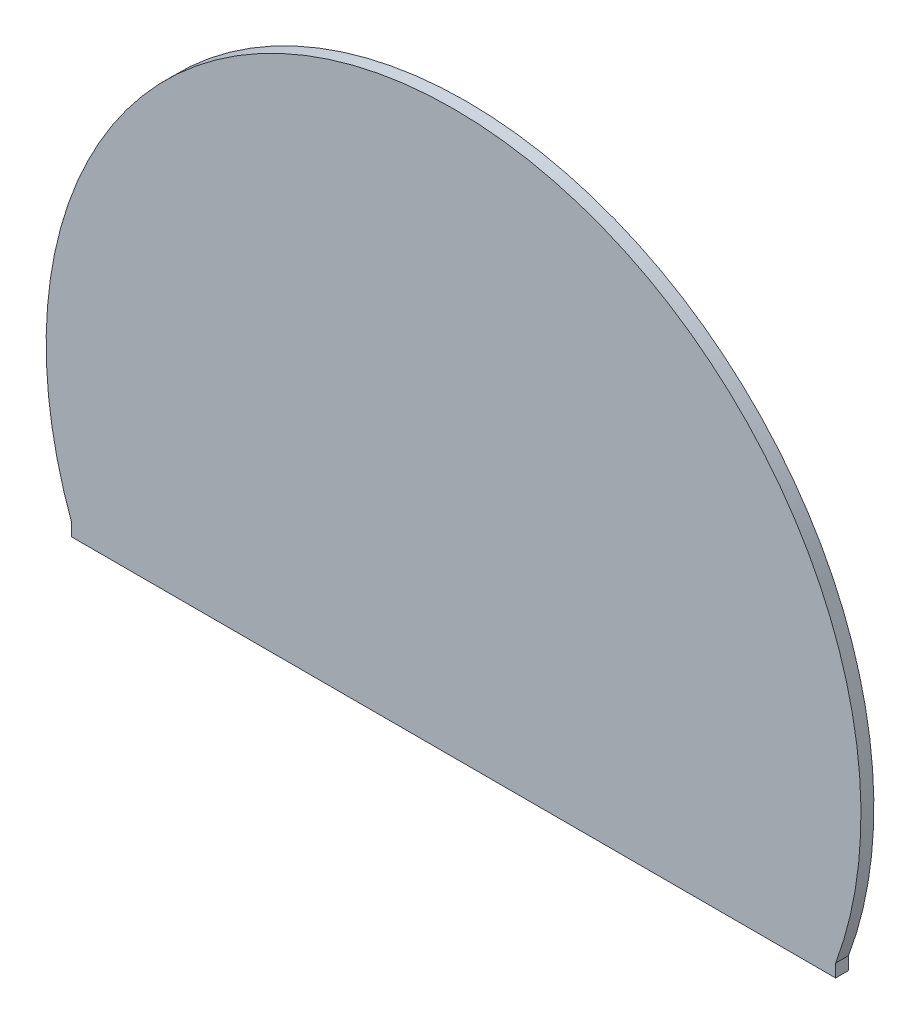
ISO-10303-21;
HEADER;
FILE_DESCRIPTION(('STEP AP214'),'2;1');
FILE_NAME('part.step','',(''),(''),'','','');
FILE_SCHEMA(('AUTOMOTIVE_DESIGN { 1 0 10303 214 1 1 1 1 }'));
ENDSEC;
DATA;
#1=APPLICATION_CONTEXT('core data for automotive mechanical design processes');
#2=APPLICATION_PROTOCOL_DEFINITION('international standard','automotive_design',2000,#1);
#3=PRODUCT_CONTEXT('',#1,'mechanical');
#4=PRODUCT('Part','Part','',(#3));
#5=PRODUCT_RELATED_PRODUCT_CATEGORY('part','',(#4));
#6=PRODUCT_DEFINITION_FORMATION('','',#4);
#7=PRODUCT_DEFINITION_CONTEXT('part definition',#1,'design');
#8=PRODUCT_DEFINITION('design','',#6,#7);
#9=PRODUCT_DEFINITION_SHAPE('','',#8);
#10=(LENGTH_UNIT() NAMED_UNIT(*) SI_UNIT(.MILLI.,.METRE.));
#11=(NAMED_UNIT(*) PLANE_ANGLE_UNIT() SI_UNIT($,.RADIAN.));
#12=(NAMED_UNIT(*) SI_UNIT($,.STERADIAN.) SOLID_ANGLE_UNIT());
#13=UNCERTAINTY_MEASURE_WITH_UNIT(LENGTH_MEASURE(1.E-05),#10,'distance_accuracy_value','');
#14=(GEOMETRIC_REPRESENTATION_CONTEXT(3) GLOBAL_UNCERTAINTY_ASSIGNED_CONTEXT((#13)) GLOBAL_UNIT_ASSIGNED_CONTEXT((#10,
#11,#12)) REPRESENTATION_CONTEXT('',''));
#15=CARTESIAN_POINT('',(0.,0.,0.));
#16=DIRECTION('',(0.,0.,1.));
#17=DIRECTION('',(1.,0.,0.));
#18=AXIS2_PLACEMENT_3D('',#15,#16,#17);
#19=CARTESIAN_POINT('',(0.,0.,5.));
#20=DIRECTION('',(0.,0.,-1.));
#21=DIRECTION('',(-1.,0.,0.));
#22=AXIS2_PLACEMENT_3D('',#19,#20,#21);
#23=CYLINDRICAL_SURFACE('',#22,158.181818181818);
#24=CARTESIAN_POINT('',(0.,0.,0.));
#25=DIRECTION('',(0.,0.,1.));
#26=DIRECTION('',(1.,0.,0.));
#27=AXIS2_PLACEMENT_3D('',#24,#25,#26);
#28=CIRCLE('',#27,158.181818181818);
#29=CARTESIAN_POINT('',(148.338085742183,-54.9299546845852,0.));
#30=VERTEX_POINT('',#29);
#31=CARTESIAN_POINT('',(-148.338085742183,-54.9299546845852,0.));
#32=VERTEX_POINT('',#31);
#33=EDGE_CURVE('E107',#30,#32,#28,.T.);
#34=ORIENTED_EDGE('',*,*,#33,.T.);
#35=DIRECTION('',(0.,0.,-1.));
#36=VECTOR('',#35,1.);
#37=CARTESIAN_POINT('',(-148.338085742183,-54.9299546845852,5.));
#38=LINE('',#37,#36);
#39=CARTESIAN_POINT('',(-148.338085742183,-54.9299546845852,5.));
#40=VERTEX_POINT('',#39);
#41=EDGE_CURVE('E11',#40,#32,#38,.T.);
#42=ORIENTED_EDGE('',*,*,#41,.F.);
#43=CARTESIAN_POINT('',(0.,0.,5.));
#44=DIRECTION('',(0.,0.,1.));
#45=DIRECTION('',(1.,0.,0.));
#46=AXIS2_PLACEMENT_3D('',#43,#44,#45);
#47=CIRCLE('',#46,158.181818181818);
#48=CARTESIAN_POINT('',(148.338085742183,-54.9299546845852,5.));
#49=VERTEX_POINT('',#48);
#50=EDGE_CURVE('E91',#49,#40,#47,.T.);
#51=ORIENTED_EDGE('',*,*,#50,.F.);
#52=DIRECTION('',(0.,0.,-1.));
#53=VECTOR('',#52,1.);
#54=CARTESIAN_POINT('',(148.338085742183,-54.9299546845852,5.));
#55=LINE('',#54,#53);
#56=EDGE_CURVE('E103',#49,#30,#55,.T.);
#57=ORIENTED_EDGE('',*,*,#56,.T.);
#58=EDGE_LOOP('',(#34,#42,#51,#57));
#59=FACE_BOUND('',#58,.T.);
#60=ADVANCED_FACE('F39',(#59),#23,.T.);
#61=CARTESIAN_POINT('',(-148.338085742183,-59.9299546845852,5.));
#62=DIRECTION('',(1.,0.,0.));
#63=DIRECTION('',(0.,0.,-1.));
#64=AXIS2_PLACEMENT_3D('',#61,#62,#63);
#65=PLANE('',#64);
#66=DIRECTION('',(0.,-1.,0.));
#67=VECTOR('',#66,1.);
#68=CARTESIAN_POINT('',(-148.338085742183,-59.9299546845852,0.));
#69=LINE('',#68,#67);
#70=CARTESIAN_POINT('',(-148.338085742183,-59.9299546845852,0.));
#71=VERTEX_POINT('',#70);
#72=EDGE_CURVE('E96',#32,#71,#69,.T.);
#73=ORIENTED_EDGE('',*,*,#72,.T.);
#74=DIRECTION('',(0.,0.,-1.));
#75=VECTOR('',#74,1.);
#76=CARTESIAN_POINT('',(-148.338085742183,-59.9299546845852,5.));
#77=LINE('',#76,#75);
#78=CARTESIAN_POINT('',(-148.338085742183,-59.9299546845852,5.));
#79=VERTEX_POINT('',#78);
#80=EDGE_CURVE('E48',#79,#71,#77,.T.);
#81=ORIENTED_EDGE('',*,*,#80,.F.);
#82=DIRECTION('',(0.,-1.,0.));
#83=VECTOR('',#82,1.);
#84=CARTESIAN_POINT('',(-148.338085742183,-59.9299546845852,5.));
#85=LINE('',#84,#83);
#86=EDGE_CURVE('E86',#40,#79,#85,.T.);
#87=ORIENTED_EDGE('',*,*,#86,.F.);
#88=ORIENTED_EDGE('',*,*,#41,.T.);
#89=EDGE_LOOP('',(#73,#81,#87,#88));
#90=FACE_BOUND('',#89,.T.);
#91=ADVANCED_FACE('F95',(#90),#65,.F.);
#92=CARTESIAN_POINT('',(148.338085742183,-59.9299546845852,5.));
#93=DIRECTION('',(0.,1.,0.));
#94=DIRECTION('',(-1.,0.,0.));
#95=AXIS2_PLACEMENT_3D('',#92,#93,#94);
#96=PLANE('',#95);
#97=DIRECTION('',(1.,0.,0.));
#98=VECTOR('',#97,1.);
#99=CARTESIAN_POINT('',(148.338085742183,-59.9299546845852,0.));
#100=LINE('',#99,#98);
#101=CARTESIAN_POINT('',(148.338085742183,-59.9299546845852,0.));
#102=VERTEX_POINT('',#101);
#103=EDGE_CURVE('E73',#71,#102,#100,.T.);
#104=ORIENTED_EDGE('',*,*,#103,.T.);
#105=DIRECTION('',(0.,0.,-1.));
#106=VECTOR('',#105,1.);
#107=CARTESIAN_POINT('',(148.338085742183,-59.9299546845852,5.));
#108=LINE('',#107,#106);
#109=CARTESIAN_POINT('',(148.338085742183,-59.9299546845852,5.));
#110=VERTEX_POINT('',#109);
#111=EDGE_CURVE('E98',#110,#102,#108,.T.);
#112=ORIENTED_EDGE('',*,*,#111,.F.);
#113=DIRECTION('',(1.,0.,0.));
#114=VECTOR('',#113,1.);
#115=CARTESIAN_POINT('',(148.338085742183,-59.9299546845852,5.));
#116=LINE('',#115,#114);
#117=EDGE_CURVE('E89',#79,#110,#116,.T.);
#118=ORIENTED_EDGE('',*,*,#117,.F.);
#119=ORIENTED_EDGE('',*,*,#80,.T.);
#120=EDGE_LOOP('',(#104,#112,#118,#119));
#121=FACE_BOUND('',#120,.T.);
#122=ADVANCED_FACE('F99',(#121),#96,.F.);
#123=CARTESIAN_POINT('',(148.338085742183,-54.9299546845852,5.));
#124=DIRECTION('',(-1.,0.,0.));
#125=DIRECTION('',(0.,0.,1.));
#126=AXIS2_PLACEMENT_3D('',#123,#124,#125);
#127=PLANE('',#126);
#128=DIRECTION('',(0.,1.,0.));
#129=VECTOR('',#128,1.);
#130=CARTESIAN_POINT('',(148.338085742183,-54.9299546845852,0.));
#131=LINE('',#130,#129);
#132=EDGE_CURVE('E79',#102,#30,#131,.T.);
#133=ORIENTED_EDGE('',*,*,#132,.T.);
#134=ORIENTED_EDGE('',*,*,#56,.F.);
#135=DIRECTION('',(0.,1.,0.));
#136=VECTOR('',#135,1.);
#137=CARTESIAN_POINT('',(148.338085742183,-54.9299546845852,5.));
#138=LINE('',#137,#136);
#139=EDGE_CURVE('E56',#110,#49,#138,.T.);
#140=ORIENTED_EDGE('',*,*,#139,.F.);
#141=ORIENTED_EDGE('',*,*,#111,.T.);
#142=EDGE_LOOP('',(#133,#134,#140,#141));
#143=FACE_BOUND('',#142,.T.);
#144=ADVANCED_FACE('F120',(#143),#127,.F.);
#145=CARTESIAN_POINT('',(0.,0.,5.));
#146=DIRECTION('',(0.,0.,1.));
#147=DIRECTION('',(1.,0.,0.));
#148=AXIS2_PLACEMENT_3D('',#145,#146,#147);
#149=PLANE('',#148);
#150=ORIENTED_EDGE('',*,*,#50,.T.);
#151=ORIENTED_EDGE('',*,*,#86,.T.);
#152=ORIENTED_EDGE('',*,*,#117,.T.);
#153=ORIENTED_EDGE('',*,*,#139,.T.);
#154=EDGE_LOOP('',(#150,#151,#152,#153));
#155=FACE_BOUND('',#154,.T.);
#156=ADVANCED_FACE('F87',(#155),#149,.T.);
#157=CARTESIAN_POINT('',(0.,0.,0.));
#158=DIRECTION('',(0.,0.,1.));
#159=DIRECTION('',(1.,0.,0.));
#160=AXIS2_PLACEMENT_3D('',#157,#158,#159);
#161=PLANE('',#160);
#162=ORIENTED_EDGE('',*,*,#33,.F.);
#163=ORIENTED_EDGE('',*,*,#132,.F.);
#164=ORIENTED_EDGE('',*,*,#103,.F.);
#165=ORIENTED_EDGE('',*,*,#72,.F.);
#166=EDGE_LOOP('',(#162,#163,#164,#165));
#167=FACE_BOUND('',#166,.T.);
#168=ADVANCED_FACE('F123',(#167),#161,.F.);
#169=CLOSED_SHELL('',(#60,#91,#122,#144,#156,#168));
#170=MANIFOLD_SOLID_BREP('B2',#169);
#171=ADVANCED_BREP_SHAPE_REPRESENTATION('',(#18,#170),#14);
#172=SHAPE_DEFINITION_REPRESENTATION(#9,#171);
ENDSEC;
END-ISO-10303-21;
